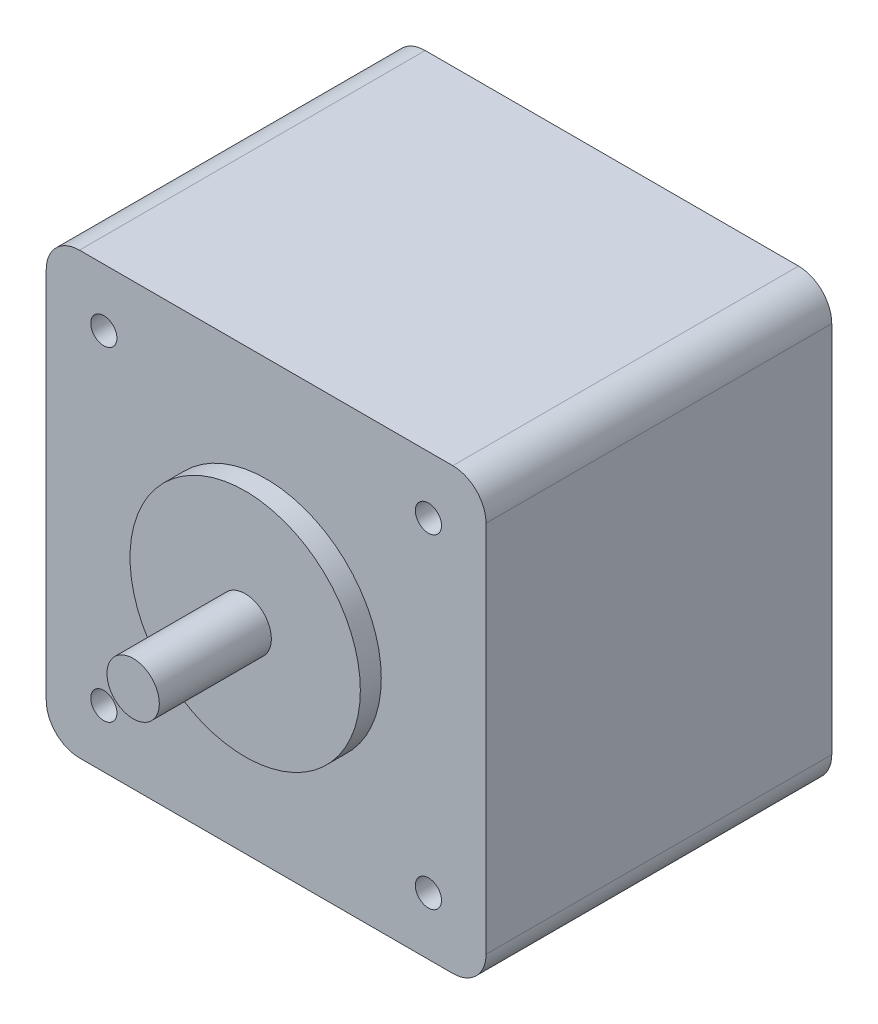
ISO-10303-21;
HEADER;
FILE_DESCRIPTION(('STEP AP214'),'2;1');
FILE_NAME('part.step','',(''),(''),'','','');
FILE_SCHEMA(('AUTOMOTIVE_DESIGN { 1 0 10303 214 1 1 1 1 }'));
ENDSEC;
DATA;
#1=APPLICATION_CONTEXT('core data for automotive mechanical design processes');
#2=APPLICATION_PROTOCOL_DEFINITION('international standard','automotive_design',2000,#1);
#3=PRODUCT_CONTEXT('',#1,'mechanical');
#4=PRODUCT('Part','Part','',(#3));
#5=PRODUCT_RELATED_PRODUCT_CATEGORY('part','',(#4));
#6=PRODUCT_DEFINITION_FORMATION('','',#4);
#7=PRODUCT_DEFINITION_CONTEXT('part definition',#1,'design');
#8=PRODUCT_DEFINITION('design','',#6,#7);
#9=PRODUCT_DEFINITION_SHAPE('','',#8);
#10=(LENGTH_UNIT() NAMED_UNIT(*) SI_UNIT(.MILLI.,.METRE.));
#11=(NAMED_UNIT(*) PLANE_ANGLE_UNIT() SI_UNIT($,.RADIAN.));
#12=(NAMED_UNIT(*) SI_UNIT($,.STERADIAN.) SOLID_ANGLE_UNIT());
#13=UNCERTAINTY_MEASURE_WITH_UNIT(LENGTH_MEASURE(1.E-05),#10,'distance_accuracy_value','');
#14=(GEOMETRIC_REPRESENTATION_CONTEXT(3) GLOBAL_UNCERTAINTY_ASSIGNED_CONTEXT((#13)) GLOBAL_UNIT_ASSIGNED_CONTEXT((#10,
#11,#12)) REPRESENTATION_CONTEXT('',''));
#15=CARTESIAN_POINT('',(0.,0.,0.));
#16=DIRECTION('',(0.,0.,1.));
#17=DIRECTION('',(1.,0.,0.));
#18=AXIS2_PLACEMENT_3D('',#15,#16,#17);
#19=CARTESIAN_POINT('',(-21.,-21.,0.));
#20=DIRECTION('',(0.,-1.,0.));
#21=DIRECTION('',(0.,0.,-1.));
#22=AXIS2_PLACEMENT_3D('',#19,#20,#21);
#23=PLANE('',#22);
#24=DIRECTION('',(1.,0.,0.));
#25=VECTOR('',#24,1.);
#26=CARTESIAN_POINT('',(-21.,-21.,33.02));
#27=LINE('',#26,#25);
#28=CARTESIAN_POINT('',(-17.825,-21.,33.02));
#29=VERTEX_POINT('',#28);
#30=CARTESIAN_POINT('',(17.825,-21.,33.02));
#31=VERTEX_POINT('',#30);
#32=EDGE_CURVE('E153',#29,#31,#27,.T.);
#33=ORIENTED_EDGE('',*,*,#32,.F.);
#34=DIRECTION('',(0.,0.,1.));
#35=VECTOR('',#34,1.);
#36=CARTESIAN_POINT('',(-17.825,-21.,0.));
#37=LINE('',#36,#35);
#38=CARTESIAN_POINT('',(-17.825,-21.,0.));
#39=VERTEX_POINT('',#38);
#40=EDGE_CURVE('E11',#29,#39,#37,.F.);
#41=ORIENTED_EDGE('',*,*,#40,.T.);
#42=DIRECTION('',(1.,0.,0.));
#43=VECTOR('',#42,1.);
#44=CARTESIAN_POINT('',(-21.,-21.,0.));
#45=LINE('',#44,#43);
#46=CARTESIAN_POINT('',(17.825,-21.,0.));
#47=VERTEX_POINT('',#46);
#48=EDGE_CURVE('E154',#39,#47,#45,.T.);
#49=ORIENTED_EDGE('',*,*,#48,.T.);
#50=DIRECTION('',(0.,0.,1.));
#51=VECTOR('',#50,1.);
#52=CARTESIAN_POINT('',(17.825,-21.,0.));
#53=LINE('',#52,#51);
#54=EDGE_CURVE('E43',#47,#31,#53,.T.);
#55=ORIENTED_EDGE('',*,*,#54,.T.);
#56=EDGE_LOOP('',(#33,#41,#49,#55));
#57=FACE_BOUND('',#56,.T.);
#58=ADVANCED_FACE('F35',(#57),#23,.T.);
#59=CARTESIAN_POINT('',(-21.,21.,0.));
#60=DIRECTION('',(-1.,0.,0.));
#61=DIRECTION('',(0.,-1.,0.));
#62=AXIS2_PLACEMENT_3D('',#59,#60,#61);
#63=PLANE('',#62);
#64=DIRECTION('',(0.,-1.,0.));
#65=VECTOR('',#64,1.);
#66=CARTESIAN_POINT('',(-21.,21.,33.02));
#67=LINE('',#66,#65);
#68=CARTESIAN_POINT('',(-21.,17.825,33.02));
#69=VERTEX_POINT('',#68);
#70=CARTESIAN_POINT('',(-21.,-17.825,33.02));
#71=VERTEX_POINT('',#70);
#72=EDGE_CURVE('E158',#69,#71,#67,.T.);
#73=ORIENTED_EDGE('',*,*,#72,.F.);
#74=DIRECTION('',(0.,0.,1.));
#75=VECTOR('',#74,1.);
#76=CARTESIAN_POINT('',(-21.,17.825,0.));
#77=LINE('',#76,#75);
#78=CARTESIAN_POINT('',(-21.,17.825,0.));
#79=VERTEX_POINT('',#78);
#80=EDGE_CURVE('E195',#69,#79,#77,.F.);
#81=ORIENTED_EDGE('',*,*,#80,.T.);
#82=DIRECTION('',(0.,-1.,0.));
#83=VECTOR('',#82,1.);
#84=CARTESIAN_POINT('',(-21.,21.,0.));
#85=LINE('',#84,#83);
#86=CARTESIAN_POINT('',(-21.,-17.825,0.));
#87=VERTEX_POINT('',#86);
#88=EDGE_CURVE('E163',#79,#87,#85,.T.);
#89=ORIENTED_EDGE('',*,*,#88,.T.);
#90=DIRECTION('',(0.,0.,1.));
#91=VECTOR('',#90,1.);
#92=CARTESIAN_POINT('',(-21.,-17.825,0.));
#93=LINE('',#92,#91);
#94=EDGE_CURVE('E192',#87,#71,#93,.T.);
#95=ORIENTED_EDGE('',*,*,#94,.T.);
#96=EDGE_LOOP('',(#73,#81,#89,#95));
#97=FACE_BOUND('',#96,.T.);
#98=ADVANCED_FACE('F223',(#97),#63,.T.);
#99=CARTESIAN_POINT('',(21.,21.,0.));
#100=DIRECTION('',(0.,1.,0.));
#101=DIRECTION('',(-1.,0.,0.));
#102=AXIS2_PLACEMENT_3D('',#99,#100,#101);
#103=PLANE('',#102);
#104=DIRECTION('',(-1.,0.,0.));
#105=VECTOR('',#104,1.);
#106=CARTESIAN_POINT('',(21.,21.,0.));
#107=LINE('',#106,#105);
#108=CARTESIAN_POINT('',(17.825,21.,0.));
#109=VERTEX_POINT('',#108);
#110=CARTESIAN_POINT('',(-17.825,21.,0.));
#111=VERTEX_POINT('',#110);
#112=EDGE_CURVE('E160',#109,#111,#107,.T.);
#113=ORIENTED_EDGE('',*,*,#112,.T.);
#114=DIRECTION('',(0.,0.,1.));
#115=VECTOR('',#114,1.);
#116=CARTESIAN_POINT('',(-17.825,21.,0.));
#117=LINE('',#116,#115);
#118=CARTESIAN_POINT('',(-17.825,21.,33.02));
#119=VERTEX_POINT('',#118);
#120=EDGE_CURVE('E181',#111,#119,#117,.T.);
#121=ORIENTED_EDGE('',*,*,#120,.T.);
#122=DIRECTION('',(-1.,0.,0.));
#123=VECTOR('',#122,1.);
#124=CARTESIAN_POINT('',(21.,21.,33.02));
#125=LINE('',#124,#123);
#126=CARTESIAN_POINT('',(17.825,21.,33.02));
#127=VERTEX_POINT('',#126);
#128=EDGE_CURVE('E172',#127,#119,#125,.T.);
#129=ORIENTED_EDGE('',*,*,#128,.F.);
#130=DIRECTION('',(0.,0.,1.));
#131=VECTOR('',#130,1.);
#132=CARTESIAN_POINT('',(17.825,21.,0.));
#133=LINE('',#132,#131);
#134=EDGE_CURVE('E179',#127,#109,#133,.F.);
#135=ORIENTED_EDGE('',*,*,#134,.T.);
#136=EDGE_LOOP('',(#113,#121,#129,#135));
#137=FACE_BOUND('',#136,.T.);
#138=ADVANCED_FACE('F233',(#137),#103,.T.);
#139=CARTESIAN_POINT('',(21.,-21.,0.));
#140=DIRECTION('',(1.,0.,0.));
#141=DIRECTION('',(0.,1.,0.));
#142=AXIS2_PLACEMENT_3D('',#139,#140,#141);
#143=PLANE('',#142);
#144=DIRECTION('',(0.,1.,0.));
#145=VECTOR('',#144,1.);
#146=CARTESIAN_POINT('',(21.,-21.,0.));
#147=LINE('',#146,#145);
#148=CARTESIAN_POINT('',(21.,-17.825,0.));
#149=VERTEX_POINT('',#148);
#150=CARTESIAN_POINT('',(21.,17.825,0.));
#151=VERTEX_POINT('',#150);
#152=EDGE_CURVE('E157',#149,#151,#147,.T.);
#153=ORIENTED_EDGE('',*,*,#152,.T.);
#154=DIRECTION('',(0.,0.,1.));
#155=VECTOR('',#154,1.);
#156=CARTESIAN_POINT('',(21.,17.825,0.));
#157=LINE('',#156,#155);
#158=CARTESIAN_POINT('',(21.,17.825,33.02));
#159=VERTEX_POINT('',#158);
#160=EDGE_CURVE('E205',#151,#159,#157,.T.);
#161=ORIENTED_EDGE('',*,*,#160,.T.);
#162=DIRECTION('',(0.,1.,0.));
#163=VECTOR('',#162,1.);
#164=CARTESIAN_POINT('',(21.,-21.,33.02));
#165=LINE('',#164,#163);
#166=CARTESIAN_POINT('',(21.,-17.825,33.02));
#167=VERTEX_POINT('',#166);
#168=EDGE_CURVE('E169',#167,#159,#165,.T.);
#169=ORIENTED_EDGE('',*,*,#168,.F.);
#170=DIRECTION('',(0.,0.,1.));
#171=VECTOR('',#170,1.);
#172=CARTESIAN_POINT('',(21.,-17.825,0.));
#173=LINE('',#172,#171);
#174=EDGE_CURVE('E57',#167,#149,#173,.F.);
#175=ORIENTED_EDGE('',*,*,#174,.T.);
#176=EDGE_LOOP('',(#153,#161,#169,#175));
#177=FACE_BOUND('',#176,.T.);
#178=ADVANCED_FACE('F238',(#177),#143,.T.);
#179=CARTESIAN_POINT('',(21.,-21.,0.));
#180=DIRECTION('',(0.,0.,1.));
#181=DIRECTION('',(1.,0.,0.));
#182=AXIS2_PLACEMENT_3D('',#179,#180,#181);
#183=PLANE('',#182);
#184=ORIENTED_EDGE('',*,*,#88,.F.);
#185=CARTESIAN_POINT('',(-17.825,17.825,0.));
#186=DIRECTION('',(0.,0.,1.));
#187=DIRECTION('',(1.,0.,0.));
#188=AXIS2_PLACEMENT_3D('',#185,#186,#187);
#189=CIRCLE('',#188,3.175);
#190=EDGE_CURVE('E202',#79,#111,#189,.F.);
#191=ORIENTED_EDGE('',*,*,#190,.T.);
#192=ORIENTED_EDGE('',*,*,#112,.F.);
#193=CARTESIAN_POINT('',(17.825,17.825,0.));
#194=DIRECTION('',(0.,0.,1.));
#195=DIRECTION('',(1.,0.,0.));
#196=AXIS2_PLACEMENT_3D('',#193,#194,#195);
#197=CIRCLE('',#196,3.175);
#198=EDGE_CURVE('E50',#109,#151,#197,.F.);
#199=ORIENTED_EDGE('',*,*,#198,.T.);
#200=ORIENTED_EDGE('',*,*,#152,.F.);
#201=CARTESIAN_POINT('',(17.825,-17.825,0.));
#202=DIRECTION('',(0.,0.,1.));
#203=DIRECTION('',(1.,0.,0.));
#204=AXIS2_PLACEMENT_3D('',#201,#202,#203);
#205=CIRCLE('',#204,3.175);
#206=EDGE_CURVE('E197',#149,#47,#205,.F.);
#207=ORIENTED_EDGE('',*,*,#206,.T.);
#208=ORIENTED_EDGE('',*,*,#48,.F.);
#209=CARTESIAN_POINT('',(-17.825,-17.825,0.));
#210=DIRECTION('',(0.,0.,1.));
#211=DIRECTION('',(1.,0.,0.));
#212=AXIS2_PLACEMENT_3D('',#209,#210,#211);
#213=CIRCLE('',#212,3.175);
#214=EDGE_CURVE('E199',#39,#87,#213,.F.);
#215=ORIENTED_EDGE('',*,*,#214,.T.);
#216=EDGE_LOOP('',(#184,#191,#192,#199,#200,#207,#208,#215));
#217=FACE_BOUND('',#216,.T.);
#218=ADVANCED_FACE('F227',(#217),#183,.F.);
#219=CARTESIAN_POINT('',(21.,-21.,33.02));
#220=DIRECTION('',(0.,0.,1.));
#221=DIRECTION('',(1.,0.,0.));
#222=AXIS2_PLACEMENT_3D('',#219,#220,#221);
#223=PLANE('',#222);
#224=CARTESIAN_POINT('',(-15.5,15.5,33.02));
#225=DIRECTION('',(0.,0.,1.));
#226=DIRECTION('',(1.,0.,0.));
#227=AXIS2_PLACEMENT_3D('',#224,#225,#226);
#228=CIRCLE('',#227,1.25);
#229=CARTESIAN_POINT('',(-14.25,15.5,33.02));
#230=VERTEX_POINT('',#229);
#231=EDGE_CURVE('E122',#230,#230,#228,.T.);
#232=ORIENTED_EDGE('',*,*,#231,.F.);
#233=EDGE_LOOP('',(#232));
#234=FACE_BOUND('',#233,.T.);
#235=CARTESIAN_POINT('',(-15.4999999999996,-15.5,33.02));
#236=DIRECTION('',(0.,0.,1.));
#237=DIRECTION('',(1.,0.,0.));
#238=AXIS2_PLACEMENT_3D('',#235,#236,#237);
#239=CIRCLE('',#238,1.25);
#240=CARTESIAN_POINT('',(-14.2499999999996,-15.5,33.02));
#241=VERTEX_POINT('',#240);
#242=EDGE_CURVE('E121',#241,#241,#239,.T.);
#243=ORIENTED_EDGE('',*,*,#242,.F.);
#244=EDGE_LOOP('',(#243));
#245=FACE_BOUND('',#244,.T.);
#246=CARTESIAN_POINT('',(15.5000000000004,-15.4999999999996,33.02));
#247=DIRECTION('',(0.,0.,1.));
#248=DIRECTION('',(1.,0.,0.));
#249=AXIS2_PLACEMENT_3D('',#246,#247,#248);
#250=CIRCLE('',#249,1.25);
#251=CARTESIAN_POINT('',(16.7500000000004,-15.4999999999996,33.02));
#252=VERTEX_POINT('',#251);
#253=EDGE_CURVE('E132',#252,#252,#250,.T.);
#254=ORIENTED_EDGE('',*,*,#253,.F.);
#255=EDGE_LOOP('',(#254));
#256=FACE_BOUND('',#255,.T.);
#257=CARTESIAN_POINT('',(15.4999999999998,15.5000000000002,33.02));
#258=DIRECTION('',(0.,0.,1.));
#259=DIRECTION('',(1.,0.,0.));
#260=AXIS2_PLACEMENT_3D('',#257,#258,#259);
#261=CIRCLE('',#260,1.25);
#262=CARTESIAN_POINT('',(16.7499999999998,15.5000000000002,33.02));
#263=VERTEX_POINT('',#262);
#264=EDGE_CURVE('E138',#263,#263,#261,.T.);
#265=ORIENTED_EDGE('',*,*,#264,.F.);
#266=EDGE_LOOP('',(#265));
#267=FACE_BOUND('',#266,.T.);
#268=CARTESIAN_POINT('',(0.,0.,33.02));
#269=DIRECTION('',(0.,0.,1.));
#270=DIRECTION('',(1.,0.,0.));
#271=AXIS2_PLACEMENT_3D('',#268,#269,#270);
#272=CIRCLE('',#271,10.9982);
#273=CARTESIAN_POINT('',(10.9982,0.,33.02));
#274=VERTEX_POINT('',#273);
#275=EDGE_CURVE('E166',#274,#274,#272,.T.);
#276=ORIENTED_EDGE('',*,*,#275,.F.);
#277=EDGE_LOOP('',(#276));
#278=FACE_BOUND('',#277,.T.);
#279=ORIENTED_EDGE('',*,*,#128,.T.);
#280=CARTESIAN_POINT('',(-17.825,17.825,33.02));
#281=DIRECTION('',(0.,0.,1.));
#282=DIRECTION('',(1.,0.,0.));
#283=AXIS2_PLACEMENT_3D('',#280,#281,#282);
#284=CIRCLE('',#283,3.175);
#285=EDGE_CURVE('E190',#119,#69,#284,.T.);
#286=ORIENTED_EDGE('',*,*,#285,.T.);
#287=ORIENTED_EDGE('',*,*,#72,.T.);
#288=CARTESIAN_POINT('',(-17.825,-17.825,33.02));
#289=DIRECTION('',(0.,0.,1.));
#290=DIRECTION('',(1.,0.,0.));
#291=AXIS2_PLACEMENT_3D('',#288,#289,#290);
#292=CIRCLE('',#291,3.175);
#293=EDGE_CURVE('E186',#71,#29,#292,.T.);
#294=ORIENTED_EDGE('',*,*,#293,.T.);
#295=ORIENTED_EDGE('',*,*,#32,.T.);
#296=CARTESIAN_POINT('',(17.825,-17.825,33.02));
#297=DIRECTION('',(0.,0.,1.));
#298=DIRECTION('',(1.,0.,0.));
#299=AXIS2_PLACEMENT_3D('',#296,#297,#298);
#300=CIRCLE('',#299,3.175);
#301=EDGE_CURVE('E184',#31,#167,#300,.T.);
#302=ORIENTED_EDGE('',*,*,#301,.T.);
#303=ORIENTED_EDGE('',*,*,#168,.T.);
#304=CARTESIAN_POINT('',(17.825,17.825,33.02));
#305=DIRECTION('',(0.,0.,1.));
#306=DIRECTION('',(1.,0.,0.));
#307=AXIS2_PLACEMENT_3D('',#304,#305,#306);
#308=CIRCLE('',#307,3.175);
#309=EDGE_CURVE('E188',#159,#127,#308,.T.);
#310=ORIENTED_EDGE('',*,*,#309,.T.);
#311=EDGE_LOOP('',(#279,#286,#287,#294,#295,#302,#303,#310));
#312=FACE_BOUND('',#311,.T.);
#313=ADVANCED_FACE('F216',(#234,#245,#256,#267,#278,#312),#223,.T.);
#314=CARTESIAN_POINT('',(0.,0.,33.02));
#315=DIRECTION('',(0.,0.,1.));
#316=DIRECTION('',(1.,0.,0.));
#317=AXIS2_PLACEMENT_3D('',#314,#315,#316);
#318=CYLINDRICAL_SURFACE('',#317,10.9982);
#319=ORIENTED_EDGE('',*,*,#275,.T.);
#320=EDGE_LOOP('',(#319));
#321=FACE_BOUND('',#320,.T.);
#322=CARTESIAN_POINT('',(0.,0.,35.02));
#323=DIRECTION('',(0.,0.,1.));
#324=DIRECTION('',(1.,0.,0.));
#325=AXIS2_PLACEMENT_3D('',#322,#323,#324);
#326=CIRCLE('',#325,10.9982);
#327=CARTESIAN_POINT('',(10.9982,0.,35.02));
#328=VERTEX_POINT('',#327);
#329=EDGE_CURVE('E144',#328,#328,#326,.T.);
#330=ORIENTED_EDGE('',*,*,#329,.F.);
#331=EDGE_LOOP('',(#330));
#332=FACE_BOUND('',#331,.T.);
#333=ADVANCED_FACE('F378',(#321,#332),#318,.T.);
#334=CARTESIAN_POINT('',(0.,0.,45.72));
#335=DIRECTION('',(0.,0.,1.));
#336=DIRECTION('',(1.,0.,0.));
#337=AXIS2_PLACEMENT_3D('',#334,#335,#336);
#338=PLANE('',#337);
#339=CARTESIAN_POINT('',(0.,0.,45.72));
#340=DIRECTION('',(0.,0.,1.));
#341=DIRECTION('',(1.,0.,0.));
#342=AXIS2_PLACEMENT_3D('',#339,#340,#341);
#343=CIRCLE('',#342,2.5);
#344=CARTESIAN_POINT('',(2.5,0.,45.72));
#345=VERTEX_POINT('',#344);
#346=EDGE_CURVE('E150',#345,#345,#343,.T.);
#347=ORIENTED_EDGE('',*,*,#346,.T.);
#348=EDGE_LOOP('',(#347));
#349=FACE_BOUND('',#348,.T.);
#350=ADVANCED_FACE('F369',(#349),#338,.T.);
#351=CARTESIAN_POINT('',(0.,0.,33.02));
#352=DIRECTION('',(0.,0.,1.));
#353=DIRECTION('',(1.,0.,0.));
#354=AXIS2_PLACEMENT_3D('',#351,#352,#353);
#355=CYLINDRICAL_SURFACE('',#354,2.5);
#356=CARTESIAN_POINT('',(0.,0.,35.02));
#357=DIRECTION('',(0.,0.,1.));
#358=DIRECTION('',(1.,0.,0.));
#359=AXIS2_PLACEMENT_3D('',#356,#357,#358);
#360=CIRCLE('',#359,2.5);
#361=CARTESIAN_POINT('',(2.5,0.,35.02));
#362=VERTEX_POINT('',#361);
#363=EDGE_CURVE('E147',#362,#362,#360,.T.);
#364=ORIENTED_EDGE('',*,*,#363,.T.);
#365=EDGE_LOOP('',(#364));
#366=FACE_BOUND('',#365,.T.);
#367=ORIENTED_EDGE('',*,*,#346,.F.);
#368=EDGE_LOOP('',(#367));
#369=FACE_BOUND('',#368,.T.);
#370=ADVANCED_FACE('F359',(#366,#369),#355,.T.);
#371=CARTESIAN_POINT('',(2.5,0.,35.02));
#372=DIRECTION('',(0.,0.,1.));
#373=DIRECTION('',(1.,0.,0.));
#374=AXIS2_PLACEMENT_3D('',#371,#372,#373);
#375=PLANE('',#374);
#376=ORIENTED_EDGE('',*,*,#329,.T.);
#377=EDGE_LOOP('',(#376));
#378=FACE_BOUND('',#377,.T.);
#379=ORIENTED_EDGE('',*,*,#363,.F.);
#380=EDGE_LOOP('',(#379));
#381=FACE_BOUND('',#380,.T.);
#382=ADVANCED_FACE('F350',(#378,#381),#375,.T.);
#383=CARTESIAN_POINT('',(15.4999999999998,15.5000000000002,25.52));
#384=DIRECTION('',(0.,0.,1.));
#385=DIRECTION('',(1.,0.,0.));
#386=AXIS2_PLACEMENT_3D('',#383,#384,#385);
#387=CONICAL_SURFACE('',#386,1.25,1.02974425867665);
#388=CARTESIAN_POINT('',(15.4999999999998,15.5000000000002,24.7689242262156));
#389=VERTEX_POINT('',#388);
#390=VERTEX_LOOP('',#389);
#391=FACE_BOUND('',#390,.T.);
#392=CARTESIAN_POINT('',(15.4999999999998,15.5000000000002,25.52));
#393=DIRECTION('',(0.,0.,1.));
#394=DIRECTION('',(1.,0.,0.));
#395=AXIS2_PLACEMENT_3D('',#392,#393,#394);
#396=CIRCLE('',#395,1.25);
#397=CARTESIAN_POINT('',(16.7499999999998,15.5000000000002,25.52));
#398=VERTEX_POINT('',#397);
#399=EDGE_CURVE('E141',#398,#398,#396,.T.);
#400=ORIENTED_EDGE('',*,*,#399,.T.);
#401=EDGE_LOOP('',(#400));
#402=FACE_BOUND('',#401,.T.);
#403=ADVANCED_FACE('F341',(#391,#402),#387,.F.);
#404=CARTESIAN_POINT('',(15.4999999999998,15.5000000000002,33.02));
#405=DIRECTION('',(0.,0.,1.));
#406=DIRECTION('',(1.,0.,0.));
#407=AXIS2_PLACEMENT_3D('',#404,#405,#406);
#408=CYLINDRICAL_SURFACE('',#407,1.25);
#409=ORIENTED_EDGE('',*,*,#399,.F.);
#410=EDGE_LOOP('',(#409));
#411=FACE_BOUND('',#410,.T.);
#412=ORIENTED_EDGE('',*,*,#264,.T.);
#413=EDGE_LOOP('',(#412));
#414=FACE_BOUND('',#413,.T.);
#415=ADVANCED_FACE('F332',(#411,#414),#408,.F.);
#416=CARTESIAN_POINT('',(15.5000000000004,-15.4999999999996,25.52));
#417=DIRECTION('',(0.,0.,1.));
#418=DIRECTION('',(1.,0.,0.));
#419=AXIS2_PLACEMENT_3D('',#416,#417,#418);
#420=CONICAL_SURFACE('',#419,1.25,1.02974425867665);
#421=CARTESIAN_POINT('',(15.5000000000004,-15.4999999999996,24.7689242262156));
#422=VERTEX_POINT('',#421);
#423=VERTEX_LOOP('',#422);
#424=FACE_BOUND('',#423,.T.);
#425=CARTESIAN_POINT('',(15.5000000000004,-15.4999999999996,25.52));
#426=DIRECTION('',(0.,0.,1.));
#427=DIRECTION('',(1.,0.,0.));
#428=AXIS2_PLACEMENT_3D('',#425,#426,#427);
#429=CIRCLE('',#428,1.25);
#430=CARTESIAN_POINT('',(16.7500000000004,-15.4999999999996,25.52));
#431=VERTEX_POINT('',#430);
#432=EDGE_CURVE('E135',#431,#431,#429,.T.);
#433=ORIENTED_EDGE('',*,*,#432,.T.);
#434=EDGE_LOOP('',(#433));
#435=FACE_BOUND('',#434,.T.);
#436=ADVANCED_FACE('F323',(#424,#435),#420,.F.);
#437=CARTESIAN_POINT('',(15.5000000000004,-15.4999999999996,33.02));
#438=DIRECTION('',(0.,0.,1.));
#439=DIRECTION('',(1.,0.,0.));
#440=AXIS2_PLACEMENT_3D('',#437,#438,#439);
#441=CYLINDRICAL_SURFACE('',#440,1.25);
#442=ORIENTED_EDGE('',*,*,#432,.F.);
#443=EDGE_LOOP('',(#442));
#444=FACE_BOUND('',#443,.T.);
#445=ORIENTED_EDGE('',*,*,#253,.T.);
#446=EDGE_LOOP('',(#445));
#447=FACE_BOUND('',#446,.T.);
#448=ADVANCED_FACE('F314',(#444,#447),#441,.F.);
#449=CARTESIAN_POINT('',(-15.4999999999996,-15.5,25.52));
#450=DIRECTION('',(0.,0.,1.));
#451=DIRECTION('',(1.,0.,0.));
#452=AXIS2_PLACEMENT_3D('',#449,#450,#451);
#453=CONICAL_SURFACE('',#452,1.25,1.02974425867665);
#454=CARTESIAN_POINT('',(-15.4999999999996,-15.5,24.7689242262156));
#455=VERTEX_POINT('',#454);
#456=VERTEX_LOOP('',#455);
#457=FACE_BOUND('',#456,.T.);
#458=CARTESIAN_POINT('',(-15.4999999999996,-15.5,25.52));
#459=DIRECTION('',(0.,0.,1.));
#460=DIRECTION('',(1.,0.,0.));
#461=AXIS2_PLACEMENT_3D('',#458,#459,#460);
#462=CIRCLE('',#461,1.25);
#463=CARTESIAN_POINT('',(-14.2499999999996,-15.5,25.52));
#464=VERTEX_POINT('',#463);
#465=EDGE_CURVE('E125',#464,#464,#462,.T.);
#466=ORIENTED_EDGE('',*,*,#465,.T.);
#467=EDGE_LOOP('',(#466));
#468=FACE_BOUND('',#467,.T.);
#469=ADVANCED_FACE('F305',(#457,#468),#453,.F.);
#470=CARTESIAN_POINT('',(-15.4999999999996,-15.5,33.02));
#471=DIRECTION('',(0.,0.,1.));
#472=DIRECTION('',(1.,0.,0.));
#473=AXIS2_PLACEMENT_3D('',#470,#471,#472);
#474=CYLINDRICAL_SURFACE('',#473,1.25);
#475=ORIENTED_EDGE('',*,*,#465,.F.);
#476=EDGE_LOOP('',(#475));
#477=FACE_BOUND('',#476,.T.);
#478=ORIENTED_EDGE('',*,*,#242,.T.);
#479=EDGE_LOOP('',(#478));
#480=FACE_BOUND('',#479,.T.);
#481=ADVANCED_FACE('F115',(#477,#480),#474,.F.);
#482=CARTESIAN_POINT('',(-15.5,15.5,25.52));
#483=DIRECTION('',(0.,0.,1.));
#484=DIRECTION('',(1.,0.,0.));
#485=AXIS2_PLACEMENT_3D('',#482,#483,#484);
#486=CONICAL_SURFACE('',#485,1.25,1.02974425867665);
#487=CARTESIAN_POINT('',(-15.5,15.5,24.7689242262156));
#488=VERTEX_POINT('',#487);
#489=VERTEX_LOOP('',#488);
#490=FACE_BOUND('',#489,.T.);
#491=CARTESIAN_POINT('',(-15.5,15.5,25.52));
#492=DIRECTION('',(0.,0.,1.));
#493=DIRECTION('',(1.,0.,0.));
#494=AXIS2_PLACEMENT_3D('',#491,#492,#493);
#495=CIRCLE('',#494,1.25);
#496=CARTESIAN_POINT('',(-14.25,15.5,25.52));
#497=VERTEX_POINT('',#496);
#498=EDGE_CURVE('E119',#497,#497,#495,.T.);
#499=ORIENTED_EDGE('',*,*,#498,.T.);
#500=EDGE_LOOP('',(#499));
#501=FACE_BOUND('',#500,.T.);
#502=ADVANCED_FACE('F111',(#490,#501),#486,.F.);
#503=CARTESIAN_POINT('',(-15.5,15.5,33.02));
#504=DIRECTION('',(0.,0.,1.));
#505=DIRECTION('',(1.,0.,0.));
#506=AXIS2_PLACEMENT_3D('',#503,#504,#505);
#507=CYLINDRICAL_SURFACE('',#506,1.25);
#508=ORIENTED_EDGE('',*,*,#498,.F.);
#509=EDGE_LOOP('',(#508));
#510=FACE_BOUND('',#509,.T.);
#511=ORIENTED_EDGE('',*,*,#231,.T.);
#512=EDGE_LOOP('',(#511));
#513=FACE_BOUND('',#512,.T.);
#514=ADVANCED_FACE('F114',(#510,#513),#507,.F.);
#515=CARTESIAN_POINT('',(-17.825,17.825,0.));
#516=DIRECTION('',(0.,0.,1.));
#517=DIRECTION('',(1.,0.,0.));
#518=AXIS2_PLACEMENT_3D('',#515,#516,#517);
#519=CYLINDRICAL_SURFACE('',#518,3.175);
#520=ORIENTED_EDGE('',*,*,#190,.F.);
#521=ORIENTED_EDGE('',*,*,#80,.F.);
#522=ORIENTED_EDGE('',*,*,#285,.F.);
#523=ORIENTED_EDGE('',*,*,#120,.F.);
#524=EDGE_LOOP('',(#520,#521,#522,#523));
#525=FACE_BOUND('',#524,.T.);
#526=ADVANCED_FACE('F230',(#525),#519,.T.);
#527=CARTESIAN_POINT('',(17.825,17.825,0.));
#528=DIRECTION('',(0.,0.,1.));
#529=DIRECTION('',(1.,0.,0.));
#530=AXIS2_PLACEMENT_3D('',#527,#528,#529);
#531=CYLINDRICAL_SURFACE('',#530,3.175);
#532=ORIENTED_EDGE('',*,*,#198,.F.);
#533=ORIENTED_EDGE('',*,*,#134,.F.);
#534=ORIENTED_EDGE('',*,*,#309,.F.);
#535=ORIENTED_EDGE('',*,*,#160,.F.);
#536=EDGE_LOOP('',(#532,#533,#534,#535));
#537=FACE_BOUND('',#536,.T.);
#538=ADVANCED_FACE('F237',(#537),#531,.T.);
#539=CARTESIAN_POINT('',(-17.825,-17.825,0.));
#540=DIRECTION('',(0.,0.,1.));
#541=DIRECTION('',(1.,0.,0.));
#542=AXIS2_PLACEMENT_3D('',#539,#540,#541);
#543=CYLINDRICAL_SURFACE('',#542,3.175);
#544=ORIENTED_EDGE('',*,*,#214,.F.);
#545=ORIENTED_EDGE('',*,*,#40,.F.);
#546=ORIENTED_EDGE('',*,*,#293,.F.);
#547=ORIENTED_EDGE('',*,*,#94,.F.);
#548=EDGE_LOOP('',(#544,#545,#546,#547));
#549=FACE_BOUND('',#548,.T.);
#550=ADVANCED_FACE('F221',(#549),#543,.T.);
#551=CARTESIAN_POINT('',(17.825,-17.825,0.));
#552=DIRECTION('',(0.,0.,1.));
#553=DIRECTION('',(1.,0.,0.));
#554=AXIS2_PLACEMENT_3D('',#551,#552,#553);
#555=CYLINDRICAL_SURFACE('',#554,3.175);
#556=ORIENTED_EDGE('',*,*,#206,.F.);
#557=ORIENTED_EDGE('',*,*,#174,.F.);
#558=ORIENTED_EDGE('',*,*,#301,.F.);
#559=ORIENTED_EDGE('',*,*,#54,.F.);
#560=EDGE_LOOP('',(#556,#557,#558,#559));
#561=FACE_BOUND('',#560,.T.);
#562=ADVANCED_FACE('F37',(#561),#555,.T.);
#563=CLOSED_SHELL('',(#58,#98,#138,#178,#218,#313,#333,#350,#370,#382,#403,#415,#436,#448,#469,
#481,#502,#514,#526,#538,#550,#562));
#564=MANIFOLD_SOLID_BREP('B2',#563);
#565=ADVANCED_BREP_SHAPE_REPRESENTATION('',(#18,#564),#14);
#566=SHAPE_DEFINITION_REPRESENTATION(#9,#565);
ENDSEC;
END-ISO-10303-21;
